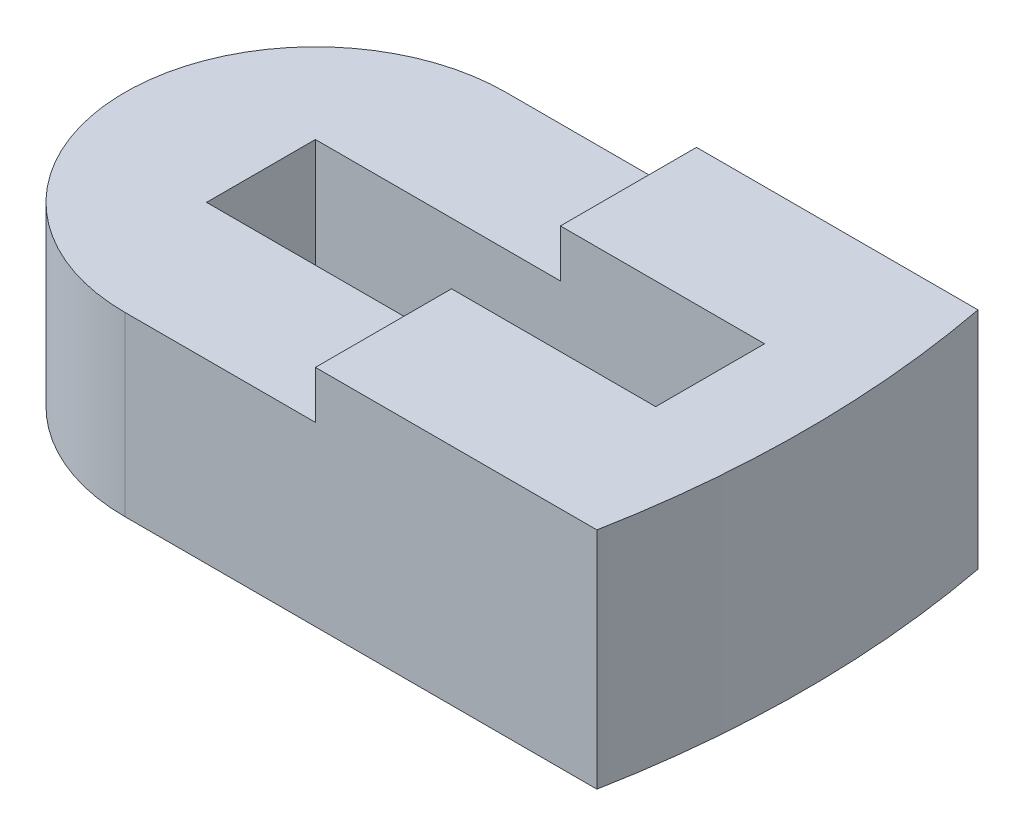
ISO-10303-21;
HEADER;
FILE_DESCRIPTION(('STEP AP214'),'2;1');
FILE_NAME('part.step','',(''),(''),'','','');
FILE_SCHEMA(('AUTOMOTIVE_DESIGN { 1 0 10303 214 1 1 1 1 }'));
ENDSEC;
DATA;
#1=APPLICATION_CONTEXT('core data for automotive mechanical design processes');
#2=APPLICATION_PROTOCOL_DEFINITION('international standard','automotive_design',2000,#1);
#3=PRODUCT_CONTEXT('',#1,'mechanical');
#4=PRODUCT('Part','Part','',(#3));
#5=PRODUCT_RELATED_PRODUCT_CATEGORY('part','',(#4));
#6=PRODUCT_DEFINITION_FORMATION('','',#4);
#7=PRODUCT_DEFINITION_CONTEXT('part definition',#1,'design');
#8=PRODUCT_DEFINITION('design','',#6,#7);
#9=PRODUCT_DEFINITION_SHAPE('','',#8);
#10=(LENGTH_UNIT() NAMED_UNIT(*) SI_UNIT(.MILLI.,.METRE.));
#11=(NAMED_UNIT(*) PLANE_ANGLE_UNIT() SI_UNIT($,.RADIAN.));
#12=(NAMED_UNIT(*) SI_UNIT($,.STERADIAN.) SOLID_ANGLE_UNIT());
#13=UNCERTAINTY_MEASURE_WITH_UNIT(LENGTH_MEASURE(1.E-05),#10,'distance_accuracy_value','');
#14=(GEOMETRIC_REPRESENTATION_CONTEXT(3) GLOBAL_UNCERTAINTY_ASSIGNED_CONTEXT((#13)) GLOBAL_UNIT_ASSIGNED_CONTEXT((#10,
#11,#12)) REPRESENTATION_CONTEXT('',''));
#15=CARTESIAN_POINT('',(0.,0.,0.));
#16=DIRECTION('',(0.,0.,1.));
#17=DIRECTION('',(1.,0.,0.));
#18=AXIS2_PLACEMENT_3D('',#15,#16,#17);
#19=CARTESIAN_POINT('',(0.,3.,0.));
#20=DIRECTION('',(0.,1.,0.));
#21=DIRECTION('',(0.,0.,1.));
#22=AXIS2_PLACEMENT_3D('',#19,#20,#21);
#23=PLANE('',#22);
#24=DIRECTION('',(1.,0.,0.));
#25=VECTOR('',#24,1.);
#26=CARTESIAN_POINT('',(0.,3.,-4.));
#27=LINE('',#26,#25);
#28=CARTESIAN_POINT('',(25.3718247354349,3.,-4.));
#29=VERTEX_POINT('',#28);
#30=CARTESIAN_POINT('',(58.3718247354349,3.,-4.));
#31=VERTEX_POINT('',#30);
#32=EDGE_CURVE('E61',#29,#31,#27,.T.);
#33=ORIENTED_EDGE('',*,*,#32,.F.);
#34=DIRECTION('',(0.,0.,1.));
#35=VECTOR('',#34,1.);
#36=CARTESIAN_POINT('',(25.3718247354349,3.,0.));
#37=LINE('',#36,#35);
#38=CARTESIAN_POINT('',(25.3718247354349,3.,4.));
#39=VERTEX_POINT('',#38);
#40=EDGE_CURVE('E252',#29,#39,#37,.T.);
#41=ORIENTED_EDGE('',*,*,#40,.T.);
#42=DIRECTION('',(-1.,0.,0.));
#43=VECTOR('',#42,1.);
#44=CARTESIAN_POINT('',(0.,3.,4.00000000000001));
#45=LINE('',#44,#43);
#46=CARTESIAN_POINT('',(58.3718247354349,3.,4.));
#47=VERTEX_POINT('',#46);
#48=EDGE_CURVE('E48',#47,#39,#45,.T.);
#49=ORIENTED_EDGE('',*,*,#48,.F.);
#50=DIRECTION('',(0.,0.,1.));
#51=VECTOR('',#50,1.);
#52=CARTESIAN_POINT('',(58.3718247354349,3.,0.));
#53=LINE('',#52,#51);
#54=EDGE_CURVE('E11',#31,#47,#53,.T.);
#55=ORIENTED_EDGE('',*,*,#54,.F.);
#56=EDGE_LOOP('',(#33,#41,#49,#55));
#57=FACE_BOUND('',#56,.T.);
#58=ADVANCED_FACE('F39',(#57),#23,.T.);
#59=CARTESIAN_POINT('',(0.,0.,0.));
#60=DIRECTION('',(0.,1.,0.));
#61=DIRECTION('',(0.,0.,1.));
#62=AXIS2_PLACEMENT_3D('',#59,#60,#61);
#63=PLANE('',#62);
#64=DIRECTION('',(1.,0.,0.));
#65=VECTOR('',#64,1.);
#66=CARTESIAN_POINT('',(0.,0.,14.));
#67=LINE('',#66,#65);
#68=CARTESIAN_POINT('',(29.3718247354349,0.,14.));
#69=VERTEX_POINT('',#68);
#70=CARTESIAN_POINT('',(64.0535728145895,0.,14.));
#71=VERTEX_POINT('',#70);
#72=EDGE_CURVE('E140',#69,#71,#67,.T.);
#73=ORIENTED_EDGE('',*,*,#72,.F.);
#74=CARTESIAN_POINT('',(29.3718247354349,0.,0.));
#75=DIRECTION('',(0.,1.,0.));
#76=DIRECTION('',(0.,0.,1.));
#77=AXIS2_PLACEMENT_3D('',#74,#75,#76);
#78=CIRCLE('',#77,14.);
#79=CARTESIAN_POINT('',(29.3718247354349,0.,-14.));
#80=VERTEX_POINT('',#79);
#81=EDGE_CURVE('E157',#80,#69,#78,.T.);
#82=ORIENTED_EDGE('',*,*,#81,.F.);
#83=DIRECTION('',(1.,0.,0.));
#84=VECTOR('',#83,1.);
#85=CARTESIAN_POINT('',(0.,0.,-14.));
#86=LINE('',#85,#84);
#87=CARTESIAN_POINT('',(64.0535728145895,0.,-14.));
#88=VERTEX_POINT('',#87);
#89=EDGE_CURVE('E135',#80,#88,#86,.T.);
#90=ORIENTED_EDGE('',*,*,#89,.T.);
#91=CARTESIAN_POINT('',(-9.62817526456508,0.,0.));
#92=DIRECTION('',(0.,1.,0.));
#93=DIRECTION('',(0.,0.,1.));
#94=AXIS2_PLACEMENT_3D('',#91,#92,#93);
#95=CIRCLE('',#94,75.);
#96=EDGE_CURVE('E217',#71,#88,#95,.T.);
#97=ORIENTED_EDGE('',*,*,#96,.F.);
#98=EDGE_LOOP('',(#73,#82,#90,#97));
#99=FACE_BOUND('',#98,.T.);
#100=ADVANCED_FACE('F41',(#99),#63,.F.);
#101=CARTESIAN_POINT('',(58.3718247354349,16.5,0.));
#102=DIRECTION('',(-1.,0.,0.));
#103=DIRECTION('',(0.,0.,1.));
#104=AXIS2_PLACEMENT_3D('',#101,#102,#103);
#105=PLANE('',#104);
#106=DIRECTION('',(0.,-1.,0.));
#107=VECTOR('',#106,1.);
#108=CARTESIAN_POINT('',(58.3718247354349,16.5,-4.));
#109=LINE('',#108,#107);
#110=CARTESIAN_POINT('',(58.3718247354349,16.5,-4.));
#111=VERTEX_POINT('',#110);
#112=EDGE_CURVE('E214',#111,#31,#109,.T.);
#113=ORIENTED_EDGE('',*,*,#112,.T.);
#114=ORIENTED_EDGE('',*,*,#54,.T.);
#115=DIRECTION('',(0.,-1.,0.));
#116=VECTOR('',#115,1.);
#117=CARTESIAN_POINT('',(58.3718247354349,16.5,4.));
#118=LINE('',#117,#116);
#119=CARTESIAN_POINT('',(58.3718247354349,16.5,4.));
#120=VERTEX_POINT('',#119);
#121=EDGE_CURVE('E247',#120,#47,#118,.T.);
#122=ORIENTED_EDGE('',*,*,#121,.F.);
#123=DIRECTION('',(0.,0.,-1.));
#124=VECTOR('',#123,1.);
#125=CARTESIAN_POINT('',(58.3718247354349,16.5,0.));
#126=LINE('',#125,#124);
#127=EDGE_CURVE('E188',#120,#111,#126,.T.);
#128=ORIENTED_EDGE('',*,*,#127,.T.);
#129=EDGE_LOOP('',(#113,#114,#122,#128));
#130=FACE_BOUND('',#129,.T.);
#131=ADVANCED_FACE('F270',(#130),#105,.T.);
#132=CARTESIAN_POINT('',(0.,16.5,4.00000000000001));
#133=DIRECTION('',(0.,0.,1.));
#134=DIRECTION('',(1.,0.,0.));
#135=AXIS2_PLACEMENT_3D('',#132,#133,#134);
#136=PLANE('',#135);
#137=ORIENTED_EDGE('',*,*,#48,.T.);
#138=DIRECTION('',(0.,-1.,0.));
#139=VECTOR('',#138,1.);
#140=CARTESIAN_POINT('',(25.3718247354349,13.,4.));
#141=LINE('',#140,#139);
#142=CARTESIAN_POINT('',(25.3718247354349,13.,4.));
#143=VERTEX_POINT('',#142);
#144=EDGE_CURVE('E182',#143,#39,#141,.T.);
#145=ORIENTED_EDGE('',*,*,#144,.F.);
#146=DIRECTION('',(-1.,0.,0.));
#147=VECTOR('',#146,1.);
#148=CARTESIAN_POINT('',(0.,13.,4.00000000000001));
#149=LINE('',#148,#147);
#150=CARTESIAN_POINT('',(43.3718247354349,13.,4.));
#151=VERTEX_POINT('',#150);
#152=EDGE_CURVE('E168',#151,#143,#149,.T.);
#153=ORIENTED_EDGE('',*,*,#152,.F.);
#154=DIRECTION('',(0.,-1.,0.));
#155=VECTOR('',#154,1.);
#156=CARTESIAN_POINT('',(43.3718247354349,16.5,4.));
#157=LINE('',#156,#155);
#158=CARTESIAN_POINT('',(43.3718247354349,16.5,4.));
#159=VERTEX_POINT('',#158);
#160=EDGE_CURVE('E243',#159,#151,#157,.T.);
#161=ORIENTED_EDGE('',*,*,#160,.F.);
#162=DIRECTION('',(-1.,0.,0.));
#163=VECTOR('',#162,1.);
#164=CARTESIAN_POINT('',(0.,16.5,4.00000000000001));
#165=LINE('',#164,#163);
#166=EDGE_CURVE('E192',#120,#159,#165,.T.);
#167=ORIENTED_EDGE('',*,*,#166,.F.);
#168=ORIENTED_EDGE('',*,*,#121,.T.);
#169=EDGE_LOOP('',(#137,#145,#153,#161,#167,#168));
#170=FACE_BOUND('',#169,.T.);
#171=ADVANCED_FACE('F259',(#170),#136,.F.);
#172=CARTESIAN_POINT('',(43.3718247354349,16.5,0.));
#173=DIRECTION('',(1.,0.,0.));
#174=DIRECTION('',(0.,0.,-1.));
#175=AXIS2_PLACEMENT_3D('',#172,#173,#174);
#176=PLANE('',#175);
#177=ORIENTED_EDGE('',*,*,#160,.T.);
#178=DIRECTION('',(0.,0.,1.));
#179=VECTOR('',#178,1.);
#180=CARTESIAN_POINT('',(43.3718247354349,13.,0.));
#181=LINE('',#180,#179);
#182=CARTESIAN_POINT('',(43.3718247354349,13.,14.));
#183=VERTEX_POINT('',#182);
#184=EDGE_CURVE('E164',#151,#183,#181,.T.);
#185=ORIENTED_EDGE('',*,*,#184,.T.);
#186=DIRECTION('',(0.,-1.,0.));
#187=VECTOR('',#186,1.);
#188=CARTESIAN_POINT('',(43.3718247354349,16.5,14.));
#189=LINE('',#188,#187);
#190=CARTESIAN_POINT('',(43.3718247354349,16.5,14.));
#191=VERTEX_POINT('',#190);
#192=EDGE_CURVE('E239',#191,#183,#189,.T.);
#193=ORIENTED_EDGE('',*,*,#192,.F.);
#194=DIRECTION('',(0.,0.,1.));
#195=VECTOR('',#194,1.);
#196=CARTESIAN_POINT('',(43.3718247354349,16.5,0.));
#197=LINE('',#196,#195);
#198=EDGE_CURVE('E195',#159,#191,#197,.T.);
#199=ORIENTED_EDGE('',*,*,#198,.F.);
#200=EDGE_LOOP('',(#177,#185,#193,#199));
#201=FACE_BOUND('',#200,.T.);
#202=ADVANCED_FACE('F277',(#201),#176,.F.);
#203=CARTESIAN_POINT('',(0.,16.5,14.));
#204=DIRECTION('',(0.,0.,-1.));
#205=DIRECTION('',(-1.,0.,0.));
#206=AXIS2_PLACEMENT_3D('',#203,#204,#205);
#207=PLANE('',#206);
#208=ORIENTED_EDGE('',*,*,#72,.T.);
#209=DIRECTION('',(0.,-1.,0.));
#210=VECTOR('',#209,1.);
#211=CARTESIAN_POINT('',(64.0535728145895,16.5,14.));
#212=LINE('',#211,#210);
#213=CARTESIAN_POINT('',(64.0535728145895,16.5,14.));
#214=VERTEX_POINT('',#213);
#215=EDGE_CURVE('E235',#214,#71,#212,.T.);
#216=ORIENTED_EDGE('',*,*,#215,.F.);
#217=DIRECTION('',(1.,0.,0.));
#218=VECTOR('',#217,1.);
#219=CARTESIAN_POINT('',(0.,16.5,14.));
#220=LINE('',#219,#218);
#221=EDGE_CURVE('E198',#191,#214,#220,.T.);
#222=ORIENTED_EDGE('',*,*,#221,.F.);
#223=ORIENTED_EDGE('',*,*,#192,.T.);
#224=DIRECTION('',(1.,0.,0.));
#225=VECTOR('',#224,1.);
#226=CARTESIAN_POINT('',(0.,13.,14.));
#227=LINE('',#226,#225);
#228=CARTESIAN_POINT('',(29.3718247354349,13.,14.));
#229=VERTEX_POINT('',#228);
#230=EDGE_CURVE('E150',#229,#183,#227,.T.);
#231=ORIENTED_EDGE('',*,*,#230,.F.);
#232=DIRECTION('',(0.,-1.,0.));
#233=VECTOR('',#232,1.);
#234=CARTESIAN_POINT('',(29.3718247354349,13.,14.));
#235=LINE('',#234,#233);
#236=EDGE_CURVE('E141',#229,#69,#235,.T.);
#237=ORIENTED_EDGE('',*,*,#236,.T.);
#238=EDGE_LOOP('',(#208,#216,#222,#223,#231,#237));
#239=FACE_BOUND('',#238,.T.);
#240=ADVANCED_FACE('F280',(#239),#207,.F.);
#241=CARTESIAN_POINT('',(-9.62817526456508,16.5,0.));
#242=DIRECTION('',(0.,-1.,0.));
#243=DIRECTION('',(0.,0.,-1.));
#244=AXIS2_PLACEMENT_3D('',#241,#242,#243);
#245=CYLINDRICAL_SURFACE('',#244,75.);
#246=ORIENTED_EDGE('',*,*,#96,.T.);
#247=DIRECTION('',(0.,-1.,0.));
#248=VECTOR('',#247,1.);
#249=CARTESIAN_POINT('',(64.0535728145895,16.5,-14.));
#250=LINE('',#249,#248);
#251=CARTESIAN_POINT('',(64.0535728145895,16.5,-14.));
#252=VERTEX_POINT('',#251);
#253=EDGE_CURVE('E232',#252,#88,#250,.T.);
#254=ORIENTED_EDGE('',*,*,#253,.F.);
#255=CARTESIAN_POINT('',(-9.62817526456508,16.5,0.));
#256=DIRECTION('',(0.,1.,0.));
#257=DIRECTION('',(0.,0.,1.));
#258=AXIS2_PLACEMENT_3D('',#255,#256,#257);
#259=CIRCLE('',#258,75.);
#260=EDGE_CURVE('E201',#214,#252,#259,.T.);
#261=ORIENTED_EDGE('',*,*,#260,.F.);
#262=ORIENTED_EDGE('',*,*,#215,.T.);
#263=EDGE_LOOP('',(#246,#254,#261,#262));
#264=FACE_BOUND('',#263,.T.);
#265=ADVANCED_FACE('F284',(#264),#245,.T.);
#266=CARTESIAN_POINT('',(0.,16.5,-14.));
#267=DIRECTION('',(0.,0.,-1.));
#268=DIRECTION('',(-1.,0.,0.));
#269=AXIS2_PLACEMENT_3D('',#266,#267,#268);
#270=PLANE('',#269);
#271=ORIENTED_EDGE('',*,*,#89,.F.);
#272=DIRECTION('',(0.,-1.,0.));
#273=VECTOR('',#272,1.);
#274=CARTESIAN_POINT('',(29.3718247354349,13.,-14.));
#275=LINE('',#274,#273);
#276=CARTESIAN_POINT('',(29.3718247354349,13.,-14.));
#277=VERTEX_POINT('',#276);
#278=EDGE_CURVE('E128',#277,#80,#275,.T.);
#279=ORIENTED_EDGE('',*,*,#278,.F.);
#280=DIRECTION('',(1.,0.,0.));
#281=VECTOR('',#280,1.);
#282=CARTESIAN_POINT('',(0.,13.,-14.));
#283=LINE('',#282,#281);
#284=CARTESIAN_POINT('',(43.3718247354349,13.,-14.));
#285=VERTEX_POINT('',#284);
#286=EDGE_CURVE('E132',#277,#285,#283,.T.);
#287=ORIENTED_EDGE('',*,*,#286,.T.);
#288=DIRECTION('',(0.,-1.,0.));
#289=VECTOR('',#288,1.);
#290=CARTESIAN_POINT('',(43.3718247354349,16.5,-14.));
#291=LINE('',#290,#289);
#292=CARTESIAN_POINT('',(43.3718247354349,16.5,-14.));
#293=VERTEX_POINT('',#292);
#294=EDGE_CURVE('E229',#293,#285,#291,.T.);
#295=ORIENTED_EDGE('',*,*,#294,.F.);
#296=DIRECTION('',(1.,0.,0.));
#297=VECTOR('',#296,1.);
#298=CARTESIAN_POINT('',(0.,16.5,-14.));
#299=LINE('',#298,#297);
#300=EDGE_CURVE('E204',#293,#252,#299,.T.);
#301=ORIENTED_EDGE('',*,*,#300,.T.);
#302=ORIENTED_EDGE('',*,*,#253,.T.);
#303=EDGE_LOOP('',(#271,#279,#287,#295,#301,#302));
#304=FACE_BOUND('',#303,.T.);
#305=ADVANCED_FACE('F130',(#304),#270,.T.);
#306=CARTESIAN_POINT('',(43.3718247354349,16.5,0.));
#307=DIRECTION('',(1.,0.,0.));
#308=DIRECTION('',(0.,0.,-1.));
#309=AXIS2_PLACEMENT_3D('',#306,#307,#308);
#310=PLANE('',#309);
#311=ORIENTED_EDGE('',*,*,#294,.T.);
#312=DIRECTION('',(0.,0.,1.));
#313=VECTOR('',#312,1.);
#314=CARTESIAN_POINT('',(43.3718247354349,13.,0.));
#315=LINE('',#314,#313);
#316=CARTESIAN_POINT('',(43.3718247354349,13.,-4.));
#317=VERTEX_POINT('',#316);
#318=EDGE_CURVE('E154',#285,#317,#315,.T.);
#319=ORIENTED_EDGE('',*,*,#318,.T.);
#320=DIRECTION('',(0.,-1.,0.));
#321=VECTOR('',#320,1.);
#322=CARTESIAN_POINT('',(43.3718247354349,16.5,-4.));
#323=LINE('',#322,#321);
#324=CARTESIAN_POINT('',(43.3718247354349,16.5,-4.));
#325=VERTEX_POINT('',#324);
#326=EDGE_CURVE('E225',#325,#317,#323,.T.);
#327=ORIENTED_EDGE('',*,*,#326,.F.);
#328=DIRECTION('',(0.,0.,1.));
#329=VECTOR('',#328,1.);
#330=CARTESIAN_POINT('',(43.3718247354349,16.5,0.));
#331=LINE('',#330,#329);
#332=EDGE_CURVE('E208',#293,#325,#331,.T.);
#333=ORIENTED_EDGE('',*,*,#332,.F.);
#334=EDGE_LOOP('',(#311,#319,#327,#333));
#335=FACE_BOUND('',#334,.T.);
#336=ADVANCED_FACE('F291',(#335),#310,.F.);
#337=CARTESIAN_POINT('',(0.,16.5,-4.));
#338=DIRECTION('',(0.,0.,-1.));
#339=DIRECTION('',(-1.,0.,0.));
#340=AXIS2_PLACEMENT_3D('',#337,#338,#339);
#341=PLANE('',#340);
#342=ORIENTED_EDGE('',*,*,#32,.T.);
#343=ORIENTED_EDGE('',*,*,#112,.F.);
#344=DIRECTION('',(1.,0.,0.));
#345=VECTOR('',#344,1.);
#346=CARTESIAN_POINT('',(0.,16.5,-4.));
#347=LINE('',#346,#345);
#348=EDGE_CURVE('E211',#325,#111,#347,.T.);
#349=ORIENTED_EDGE('',*,*,#348,.F.);
#350=ORIENTED_EDGE('',*,*,#326,.T.);
#351=DIRECTION('',(1.,0.,0.));
#352=VECTOR('',#351,1.);
#353=CARTESIAN_POINT('',(0.,13.,-4.));
#354=LINE('',#353,#352);
#355=CARTESIAN_POINT('',(25.3718247354349,13.,-4.));
#356=VERTEX_POINT('',#355);
#357=EDGE_CURVE('E174',#356,#317,#354,.T.);
#358=ORIENTED_EDGE('',*,*,#357,.F.);
#359=DIRECTION('',(0.,-1.,0.));
#360=VECTOR('',#359,1.);
#361=CARTESIAN_POINT('',(25.3718247354349,13.,-4.));
#362=LINE('',#361,#360);
#363=EDGE_CURVE('E178',#356,#29,#362,.T.);
#364=ORIENTED_EDGE('',*,*,#363,.T.);
#365=EDGE_LOOP('',(#342,#343,#349,#350,#358,#364));
#366=FACE_BOUND('',#365,.T.);
#367=ADVANCED_FACE('F294',(#366),#341,.F.);
#368=CARTESIAN_POINT('',(0.,16.5,0.));
#369=DIRECTION('',(0.,1.,0.));
#370=DIRECTION('',(0.,0.,1.));
#371=AXIS2_PLACEMENT_3D('',#368,#369,#370);
#372=PLANE('',#371);
#373=ORIENTED_EDGE('',*,*,#127,.F.);
#374=ORIENTED_EDGE('',*,*,#166,.T.);
#375=ORIENTED_EDGE('',*,*,#198,.T.);
#376=ORIENTED_EDGE('',*,*,#221,.T.);
#377=ORIENTED_EDGE('',*,*,#260,.T.);
#378=ORIENTED_EDGE('',*,*,#300,.F.);
#379=ORIENTED_EDGE('',*,*,#332,.T.);
#380=ORIENTED_EDGE('',*,*,#348,.T.);
#381=EDGE_LOOP('',(#373,#374,#375,#376,#377,#378,#379,#380));
#382=FACE_BOUND('',#381,.T.);
#383=ADVANCED_FACE('F298',(#382),#372,.T.);
#384=CARTESIAN_POINT('',(29.3718247354349,13.,0.));
#385=DIRECTION('',(0.,-1.,0.));
#386=DIRECTION('',(0.,0.,-1.));
#387=AXIS2_PLACEMENT_3D('',#384,#385,#386);
#388=CYLINDRICAL_SURFACE('',#387,14.);
#389=ORIENTED_EDGE('',*,*,#81,.T.);
#390=ORIENTED_EDGE('',*,*,#236,.F.);
#391=CARTESIAN_POINT('',(29.3718247354349,13.,0.));
#392=DIRECTION('',(0.,1.,0.));
#393=DIRECTION('',(0.,0.,1.));
#394=AXIS2_PLACEMENT_3D('',#391,#392,#393);
#395=CIRCLE('',#394,14.);
#396=EDGE_CURVE('E144',#277,#229,#395,.T.);
#397=ORIENTED_EDGE('',*,*,#396,.F.);
#398=ORIENTED_EDGE('',*,*,#278,.T.);
#399=EDGE_LOOP('',(#389,#390,#397,#398));
#400=FACE_BOUND('',#399,.T.);
#401=ADVANCED_FACE('F145',(#400),#388,.T.);
#402=CARTESIAN_POINT('',(25.3718247354349,13.,0.));
#403=DIRECTION('',(-1.,0.,0.));
#404=DIRECTION('',(0.,0.,1.));
#405=AXIS2_PLACEMENT_3D('',#402,#403,#404);
#406=PLANE('',#405);
#407=ORIENTED_EDGE('',*,*,#40,.F.);
#408=ORIENTED_EDGE('',*,*,#363,.F.);
#409=DIRECTION('',(0.,0.,-1.));
#410=VECTOR('',#409,1.);
#411=CARTESIAN_POINT('',(25.3718247354349,13.,0.));
#412=LINE('',#411,#410);
#413=EDGE_CURVE('E171',#143,#356,#412,.T.);
#414=ORIENTED_EDGE('',*,*,#413,.F.);
#415=ORIENTED_EDGE('',*,*,#144,.T.);
#416=EDGE_LOOP('',(#407,#408,#414,#415));
#417=FACE_BOUND('',#416,.T.);
#418=ADVANCED_FACE('F264',(#417),#406,.F.);
#419=CARTESIAN_POINT('',(0.,13.,0.));
#420=DIRECTION('',(0.,1.,0.));
#421=DIRECTION('',(0.,0.,1.));
#422=AXIS2_PLACEMENT_3D('',#419,#420,#421);
#423=PLANE('',#422);
#424=ORIENTED_EDGE('',*,*,#286,.F.);
#425=ORIENTED_EDGE('',*,*,#396,.T.);
#426=ORIENTED_EDGE('',*,*,#230,.T.);
#427=ORIENTED_EDGE('',*,*,#184,.F.);
#428=ORIENTED_EDGE('',*,*,#152,.T.);
#429=ORIENTED_EDGE('',*,*,#413,.T.);
#430=ORIENTED_EDGE('',*,*,#357,.T.);
#431=ORIENTED_EDGE('',*,*,#318,.F.);
#432=EDGE_LOOP('',(#424,#425,#426,#427,#428,#429,#430,#431));
#433=FACE_BOUND('',#432,.T.);
#434=ADVANCED_FACE('F152',(#433),#423,.T.);
#435=CLOSED_SHELL('',(#58,#100,#131,#171,#202,#240,#265,#305,#336,#367,#383,#401,#418,#434));
#436=MANIFOLD_SOLID_BREP('B2',#435);
#437=ADVANCED_BREP_SHAPE_REPRESENTATION('',(#18,#436),#14);
#438=SHAPE_DEFINITION_REPRESENTATION(#9,#437);
ENDSEC;
END-ISO-10303-21;
